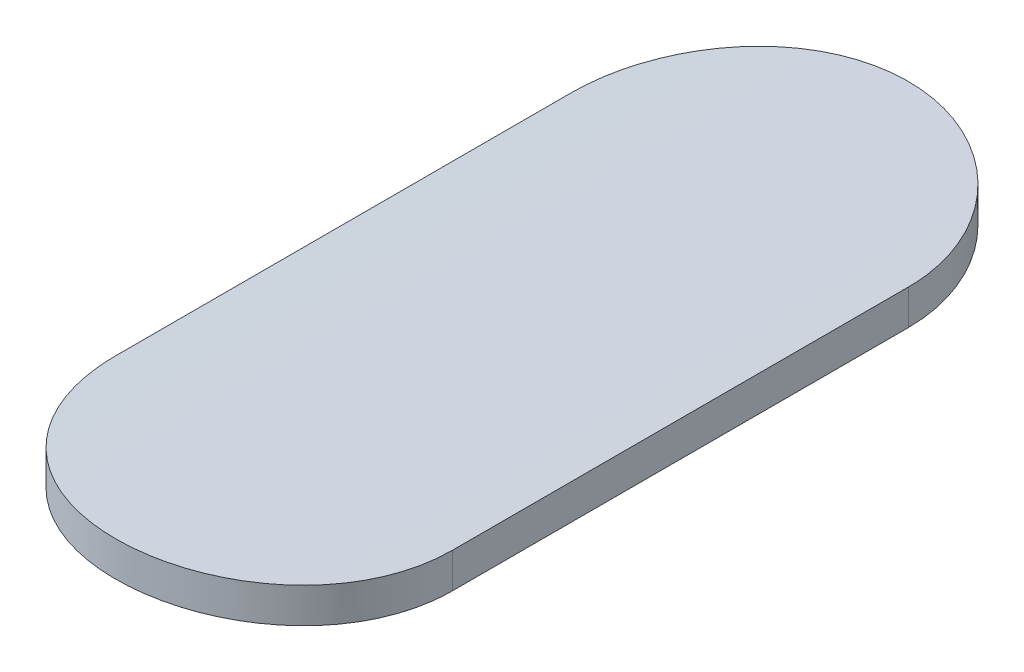
ISO-10303-21;
HEADER;
FILE_DESCRIPTION(('STEP AP214'),'2;1');
FILE_NAME('part.step','',(''),(''),'','','');
FILE_SCHEMA(('AUTOMOTIVE_DESIGN { 1 0 10303 214 1 1 1 1 }'));
ENDSEC;
DATA;
#1=APPLICATION_CONTEXT('core data for automotive mechanical design processes');
#2=APPLICATION_PROTOCOL_DEFINITION('international standard','automotive_design',2000,#1);
#3=PRODUCT_CONTEXT('',#1,'mechanical');
#4=PRODUCT('Part','Part','',(#3));
#5=PRODUCT_RELATED_PRODUCT_CATEGORY('part','',(#4));
#6=PRODUCT_DEFINITION_FORMATION('','',#4);
#7=PRODUCT_DEFINITION_CONTEXT('part definition',#1,'design');
#8=PRODUCT_DEFINITION('design','',#6,#7);
#9=PRODUCT_DEFINITION_SHAPE('','',#8);
#10=(LENGTH_UNIT() NAMED_UNIT(*) SI_UNIT(.MILLI.,.METRE.));
#11=(NAMED_UNIT(*) PLANE_ANGLE_UNIT() SI_UNIT($,.RADIAN.));
#12=(NAMED_UNIT(*) SI_UNIT($,.STERADIAN.) SOLID_ANGLE_UNIT());
#13=UNCERTAINTY_MEASURE_WITH_UNIT(LENGTH_MEASURE(1.E-05),#10,'distance_accuracy_value','');
#14=(GEOMETRIC_REPRESENTATION_CONTEXT(3) GLOBAL_UNCERTAINTY_ASSIGNED_CONTEXT((#13)) GLOBAL_UNIT_ASSIGNED_CONTEXT((#10,
#11,#12)) REPRESENTATION_CONTEXT('',''));
#15=CARTESIAN_POINT('',(0.,0.,0.));
#16=DIRECTION('',(0.,0.,1.));
#17=DIRECTION('',(1.,0.,0.));
#18=AXIS2_PLACEMENT_3D('',#15,#16,#17);
#19=CARTESIAN_POINT('',(-205.237767720161,-97.4477839792411,1.93657000024666));
#20=DIRECTION('',(0.,0.,1.));
#21=DIRECTION('',(1.,0.,0.));
#22=AXIS2_PLACEMENT_3D('',#19,#20,#21);
#23=CYLINDRICAL_SURFACE('',#22,5.00000000000003);
#24=DIRECTION('',(0.,0.,1.));
#25=VECTOR('',#24,1.);
#26=CARTESIAN_POINT('',(-205.816025312001,-92.4813347287725,-1.67728344457962));
#27=LINE('',#26,#25);
#28=CARTESIAN_POINT('',(-205.816025312001,-92.4813347287725,-3.24229252294941));
#29=VERTEX_POINT('',#28);
#30=CARTESIAN_POINT('',(-205.816025312001,-92.4813347287725,-1.67728344457962));
#31=VERTEX_POINT('',#30);
#32=EDGE_CURVE('E72',#29,#31,#27,.T.);
#33=ORIENTED_EDGE('',*,*,#32,.T.);
#34=CARTESIAN_POINT('',(-204.659510128705,-92.4813347287279,-1.67728344457962));
#35=CARTESIAN_POINT('',(-204.65948198318,-92.4813470453749,-1.64486736138541));
#36=CARTESIAN_POINT('',(-204.66223416535,-92.4810176971892,-1.61246199314016));
#37=CARTESIAN_POINT('',(-204.673088717127,-92.4797671597198,-1.54860370701117));
#38=CARTESIAN_POINT('',(-204.681185705116,-92.4788465657793,-1.51714986433024));
#39=CARTESIAN_POINT('',(-204.702524070631,-92.4765042566045,-1.45604569864238));
#40=CARTESIAN_POINT('',(-204.715767326654,-92.4750823584012,-1.42639603877621));
#41=CARTESIAN_POINT('',(-204.747006549714,-92.4719020810574,-1.36974325151918));
#42=CARTESIAN_POINT('',(-204.765001863621,-92.4701437481661,-1.34273976113282));
#43=CARTESIAN_POINT('',(-204.805325364428,-92.4664785790867,-1.29201779207968));
#44=CARTESIAN_POINT('',(-204.827671036202,-92.4645711628689,-1.26831325482103));
#45=CARTESIAN_POINT('',(-204.876032349208,-92.4608275253215,-1.22497397730184));
#46=CARTESIAN_POINT('',(-204.902049364491,-92.4589913309773,-1.20534076761728));
#47=CARTESIAN_POINT('',(-204.957107529511,-92.4555908299197,-1.17065324748611));
#48=CARTESIAN_POINT('',(-204.986158174165,-92.4540274204009,-1.15561392907275));
#49=CARTESIAN_POINT('',(-205.046371666948,-92.4513580548523,-1.13064897149647));
#50=CARTESIAN_POINT('',(-205.077531998354,-92.4502515645608,-1.1207173566954));
#51=CARTESIAN_POINT('',(-205.13034615267,-92.4488934431359,-1.10868003114148));
#52=CARTESIAN_POINT('',(-205.151664012772,-92.4484793797971,-1.10506483473562));
#53=CARTESIAN_POINT('',(-205.194574057236,-92.4479245041211,-1.10023726373118));
#54=CARTESIAN_POINT('',(-205.216166245618,-92.4477836957932,-1.09902492438865));
#55=CARTESIAN_POINT('',(-205.270132833281,-92.4477844039261,-1.09902724415098));
#56=CARTESIAN_POINT('',(-205.302518792684,-92.448101558574,-1.10175224055717));
#57=CARTESIAN_POINT('',(-205.36639046982,-92.449336246177,-1.11258048945381));
#58=CARTESIAN_POINT('',(-205.397875198235,-92.4502544143552,-1.12068943247348));
#59=CARTESIAN_POINT('',(-205.459010687186,-92.4525875978119,-1.14204449856262));
#60=CARTESIAN_POINT('',(-205.488662624789,-92.4540022902267,-1.15528728394617));
#61=CARTESIAN_POINT('',(-205.545317635545,-92.4571708752444,-1.18652753654784));
#62=CARTESIAN_POINT('',(-205.572321144898,-92.4589247118479,-1.20452421898134));
#63=CARTESIAN_POINT('',(-205.623045523049,-92.4625847434808,-1.24485186607937));
#64=CARTESIAN_POINT('',(-205.646752120136,-92.4644915478026,-1.26720072713352));
#65=CARTESIAN_POINT('',(-205.690087991771,-92.4682377457699,-1.31556202071156));
#66=CARTESIAN_POINT('',(-205.709716908808,-92.4700771334931,-1.34157477413163));
#67=CARTESIAN_POINT('',(-205.744395340358,-92.4734866329095,-1.39661981559405));
#68=CARTESIAN_POINT('',(-205.759430426865,-92.4750558895899,-1.42566124048829));
#69=CARTESIAN_POINT('',(-205.784398136002,-92.4777383200303,-1.48587384864348));
#70=CARTESIAN_POINT('',(-205.794333600315,-92.4788517477236,-1.51704383480183));
#71=CARTESIAN_POINT('',(-205.806375173798,-92.4802182866102,-1.56988157809094));
#72=CARTESIAN_POINT('',(-205.809991257807,-92.4806348583557,-1.59121323535456));
#73=CARTESIAN_POINT('',(-205.81481628588,-92.4811939415349,-1.63412129934428));
#74=CARTESIAN_POINT('',(-205.816028473882,-92.4813368222921,-1.65569733666952));
#75=CARTESIAN_POINT('',(-205.816025312001,-92.4813347287726,-1.67728344457962));
#76=B_SPLINE_CURVE_WITH_KNOTS('',3,(#34,#35,#36,#37,#38,#39,#40,#41,#42,#43,#44,#45,#46,#47,#48,
#49,#50,#51,#52,#53,#54,#55,#56,#57,#58,#59,#60,#61,#62,#63,#64,#65,#66,#67,#68,#69,#70,#71,#72,
#73,#74,#75),.UNSPECIFIED.,.F.,.F.,(4,2,2,2,2,2,2,2,2,2,2,2,2,2,2,2,2,2,2,2,4),(0.,
0.0971141698560029,0.194130705514868,0.291182687565274,0.388221337553571,0.485658369900075,
0.583131966607678,0.680920348294421,0.778594063001623,0.843344867671608,0.908096622394176,
1.0051130474093,1.10223217692016,1.19928827157682,1.29632835398478,1.39377623360661,
1.49123265335908,1.58899208404563,1.68669698057033,1.75148885975865,1.81619324588167),.UNSPECIFIED.);
#77=CARTESIAN_POINT('',(-204.659510128705,-92.4813347287279,-1.67728344457962));
#78=VERTEX_POINT('',#77);
#79=EDGE_CURVE('E21',#78,#31,#76,.T.);
#80=ORIENTED_EDGE('',*,*,#79,.F.);
#81=DIRECTION('',(0.,0.,1.));
#82=VECTOR('',#81,1.);
#83=CARTESIAN_POINT('',(-204.659510128705,-92.4813347287279,-3.24229252294941));
#84=LINE('',#83,#82);
#85=CARTESIAN_POINT('',(-204.659510128705,-92.4813347287279,-3.24229252294941));
#86=VERTEX_POINT('',#85);
#87=EDGE_CURVE('E59',#78,#86,#84,.F.);
#88=ORIENTED_EDGE('',*,*,#87,.T.);
#89=CARTESIAN_POINT('',(-205.816025312001,-92.4813347287726,-3.24229252294941));
#90=CARTESIAN_POINT('',(-205.81605345322,-92.4813470455981,-3.27470870328742));
#91=CARTESIAN_POINT('',(-205.813301256707,-92.4810176953498,-3.30711416843688));
#92=CARTESIAN_POINT('',(-205.802446677341,-92.4797671542148,-3.37097244911427));
#93=CARTESIAN_POINT('',(-205.794349708049,-92.4788465622047,-3.40242619493162));
#94=CARTESIAN_POINT('',(-205.773011592033,-92.4765042816047,-3.46352962042137));
#95=CARTESIAN_POINT('',(-205.759768660538,-92.4750824191753,-3.49317867004022));
#96=CARTESIAN_POINT('',(-205.728529674045,-92.4719021558279,-3.54983156341704));
#97=CARTESIAN_POINT('',(-205.710534070537,-92.4701437868815,-3.57683565810421));
#98=CARTESIAN_POINT('',(-205.670207756246,-92.4664783744416,-3.62756102105006));
#99=CARTESIAN_POINT('',(-205.647859171863,-92.4645707380577,-3.65126803884865));
#100=CARTESIAN_POINT('',(-205.599497501548,-92.460827112354,-3.69460636258599));
#101=CARTESIAN_POINT('',(-205.573483858366,-92.4589911339836,-3.71423704761921));
#102=CARTESIAN_POINT('',(-205.518441967116,-92.4555917582716,-3.7489134129016));
#103=CARTESIAN_POINT('',(-205.489405485113,-92.4540291382538,-3.76394610616435));
#104=CARTESIAN_POINT('',(-205.429200909222,-92.4513592357457,-3.78891582297535));
#105=CARTESIAN_POINT('',(-205.398033010825,-92.4502519115612,-3.79885331314227));
#106=CARTESIAN_POINT('',(-205.334596648131,-92.4486214638352,-3.81330876046691));
#107=CARTESIAN_POINT('',(-205.302333729771,-92.4480957495245,-3.81785075846227));
#108=CARTESIAN_POINT('',(-205.237498790808,-92.4476789168199,-3.82146077224401));
#109=CARTESIAN_POINT('',(-205.204926773204,-92.4477877922755,-3.82052884108343));
#110=CARTESIAN_POINT('',(-205.140563410856,-92.4486257894006,-3.81323661881066));
#111=CARTESIAN_POINT('',(-205.108769075323,-92.4493519393145,-3.80690233585537));
#112=CARTESIAN_POINT('',(-205.046697948224,-92.4513395212461,-3.78902585126197));
#113=CARTESIAN_POINT('',(-205.016421173954,-92.4526009593627,-3.77748359028473));
#114=CARTESIAN_POINT('',(-204.958162773233,-92.4555225006161,-3.74949052704906));
#115=CARTESIAN_POINT('',(-204.930186698027,-92.4571835321094,-3.7330282724948));
#116=CARTESIAN_POINT('',(-204.87738579882,-92.4607180906581,-3.69567163655664));
#117=CARTESIAN_POINT('',(-204.852560962508,-92.4625916168832,-3.67477727248999));
#118=CARTESIAN_POINT('',(-204.806616299284,-92.4663540775476,-3.62900660598584));
#119=CARTESIAN_POINT('',(-204.785518493568,-92.4682430387985,-3.60410819518478));
#120=CARTESIAN_POINT('',(-204.747792196947,-92.4718132541877,-3.55110334086045));
#121=CARTESIAN_POINT('',(-204.731165046413,-92.473494445952,-3.52299593882258));
#122=CARTESIAN_POINT('',(-204.702849827051,-92.4764596597479,-3.46434379804802));
#123=CARTESIAN_POINT('',(-204.691166312109,-92.4777433152941,-3.43379684274047));
#124=CARTESIAN_POINT('',(-204.67312304922,-92.479759834021,-3.37119346196273));
#125=CARTESIAN_POINT('',(-204.666755270332,-92.4804935279044,-3.3391393911043));
#126=CARTESIAN_POINT('',(-204.660710580302,-92.4811955947182,-3.28537380442094));
#127=CARTESIAN_POINT('',(-204.659499727931,-92.4813388156744,-3.26382805588258));
#128=CARTESIAN_POINT('',(-204.659510128705,-92.4813347287279,-3.24229252294941));
#129=B_SPLINE_CURVE_WITH_KNOTS('',3,(#89,#90,#91,#92,#93,#94,#95,#96,#97,#98,#99,#100,#101,#102,
#103,#104,#105,#106,#107,#108,#109,#110,#111,#112,#113,#114,#115,#116,#117,#118,#119,#120,#121,
#122,#123,#124,#125,#126,#127,#128),.UNSPECIFIED.,.F.,.F.,(4,2,2,2,2,2,2,2,2,2,2,2,2,2,2,2,2,2,
2,4),(0.,0.0971144596016323,0.194130705508774,0.291180629617421,0.388221337577801,
0.485669235955009,0.583131966690333,0.680867490696617,0.778594062484607,0.875883538275932,
0.973172071143984,1.06999486157763,1.16681875522746,1.2638698053772,1.36092047633352,
1.4585266740161,1.55616210298787,1.65388727516013,1.75146453691094,1.81606442695371),.UNSPECIFIED.);
#130=EDGE_CURVE('E73',#29,#86,#129,.T.);
#131=ORIENTED_EDGE('',*,*,#130,.F.);
#132=EDGE_LOOP('',(#33,#80,#88,#131));
#133=FACE_BOUND('',#132,.T.);
#134=ADVANCED_FACE('F17',(#133),#23,.T.);
#135=CARTESIAN_POINT('',(-205.816025312001,-90.5682667595488,-1.67728344457962));
#136=DIRECTION('',(1.,0.,0.));
#137=DIRECTION('',(0.,1.,0.));
#138=AXIS2_PLACEMENT_3D('',#135,#136,#137);
#139=PLANE('',#138);
#140=DIRECTION('',(0.,0.,1.));
#141=VECTOR('',#140,1.);
#142=CARTESIAN_POINT('',(-205.816025312001,-92.6021655298087,1.93657000024666));
#143=LINE('',#142,#141);
#144=CARTESIAN_POINT('',(-205.816025312001,-92.6021655298087,-3.24229252294941));
#145=VERTEX_POINT('',#144);
#146=CARTESIAN_POINT('',(-205.816025312001,-92.6021655298087,-1.67728344457962));
#147=VERTEX_POINT('',#146);
#148=EDGE_CURVE('E80',#145,#147,#143,.T.);
#149=ORIENTED_EDGE('',*,*,#148,.T.);
#150=DIRECTION('',(0.,1.,0.));
#151=VECTOR('',#150,1.);
#152=CARTESIAN_POINT('',(-205.816025312001,-90.5682667595488,-1.67728344457962));
#153=LINE('',#152,#151);
#154=EDGE_CURVE('E67',#31,#147,#153,.F.);
#155=ORIENTED_EDGE('',*,*,#154,.F.);
#156=ORIENTED_EDGE('',*,*,#32,.F.);
#157=DIRECTION('',(0.,1.,0.));
#158=VECTOR('',#157,1.);
#159=CARTESIAN_POINT('',(-205.816025312001,-90.5682667595488,-3.24229252294941));
#160=LINE('',#159,#158);
#161=EDGE_CURVE('E106',#145,#29,#160,.T.);
#162=ORIENTED_EDGE('',*,*,#161,.F.);
#163=EDGE_LOOP('',(#149,#155,#156,#162));
#164=FACE_BOUND('',#163,.T.);
#165=ADVANCED_FACE('F79',(#164),#139,.F.);
#166=CARTESIAN_POINT('',(-205.237767720353,-90.5682667595488,-1.67728344457962));
#167=DIRECTION('',(0.,1.,0.));
#168=DIRECTION('',(0.,0.,1.));
#169=AXIS2_PLACEMENT_3D('',#166,#167,#168);
#170=CYLINDRICAL_SURFACE('',#169,0.578257591648153);
#171=DIRECTION('',(0.,1.,0.));
#172=VECTOR('',#171,1.);
#173=CARTESIAN_POINT('',(-204.659510128705,-90.5682667595488,-1.67728344457962));
#174=LINE('',#173,#172);
#175=CARTESIAN_POINT('',(-204.659510128705,-92.6021655297629,-1.67728344457962));
#176=VERTEX_POINT('',#175);
#177=EDGE_CURVE('E69',#176,#78,#174,.T.);
#178=ORIENTED_EDGE('',*,*,#177,.T.);
#179=ORIENTED_EDGE('',*,*,#79,.T.);
#180=ORIENTED_EDGE('',*,*,#154,.T.);
#181=CARTESIAN_POINT('',(-205.816025312001,-92.6021655298087,-1.67728344457962));
#182=CARTESIAN_POINT('',(-205.816053483011,-92.6021781533448,-1.6448730846635));
#183=CARTESIAN_POINT('',(-205.813302242279,-92.6018407072796,-1.61247356318601));
#184=CARTESIAN_POINT('',(-205.802451748411,-92.6005594713111,-1.54862744613858));
#185=CARTESIAN_POINT('',(-205.79435794951,-92.5996162998216,-1.517179912889));
#186=CARTESIAN_POINT('',(-205.773028532762,-92.5972166227453,-1.45608830842007));
#187=CARTESIAN_POINT('',(-205.759791067541,-92.5957599327431,-1.42644488958729));
#188=CARTESIAN_POINT('',(-205.72856598305,-92.592501890348,-1.36980331287443));
#189=CARTESIAN_POINT('',(-205.710578992223,-92.5907005835624,-1.34280480567491));
#190=CARTESIAN_POINT('',(-205.670270074694,-92.5869454143927,-1.29208533071531));
#191=CARTESIAN_POINT('',(-205.647929782689,-92.5849909274355,-1.26837900399511));
#192=CARTESIAN_POINT('',(-205.599578955999,-92.5811547858218,-1.22503482303745));
#193=CARTESIAN_POINT('',(-205.573567048307,-92.5792731587483,-1.20539849759556));
#194=CARTESIAN_POINT('',(-205.518514038446,-92.5757880639238,-1.17070078857362));
#195=CARTESIAN_POINT('',(-205.489463015216,-92.5741855557636,-1.15565505890041));
#196=CARTESIAN_POINT('',(-205.429246573441,-92.5714492396962,-1.13067775108621));
#197=CARTESIAN_POINT('',(-205.398083675089,-92.5703148842015,-1.1207401946693));
#198=CARTESIAN_POINT('',(-205.345254120649,-92.568922106144,-1.10869179239081));
#199=CARTESIAN_POINT('',(-205.323923699689,-92.5684973477259,-1.10507220606532));
#200=CARTESIAN_POINT('',(-205.280987857234,-92.5679281371332,-1.10023875435242));
#201=CARTESIAN_POINT('',(-205.259382431801,-92.5677836889786,-1.09902492346591));
#202=CARTESIAN_POINT('',(-205.205408498434,-92.5677844137908,-1.09902724442736));
#203=CARTESIAN_POINT('',(-205.173028463901,-92.5681092485121,-1.1017512611566));
#204=CARTESIAN_POINT('',(-205.109168744159,-92.5693738397721,-1.11257543381646));
#205=CARTESIAN_POINT('',(-205.077690046997,-92.5703142460471,-1.1206812703921));
#206=CARTESIAN_POINT('',(-205.016566704827,-92.572703965736,-1.14202760073034));
#207=CARTESIAN_POINT('',(-204.986920864252,-92.5741529432019,-1.155264705521));
#208=CARTESIAN_POINT('',(-204.930276903842,-92.5773984387611,-1.18649104008967));
#209=CARTESIAN_POINT('',(-204.903278353576,-92.5791949002142,-1.20447949556857));
#210=CARTESIAN_POINT('',(-204.852556592957,-92.5829445142571,-1.24479264157334));
#211=CARTESIAN_POINT('',(-204.828848336295,-92.5848983222903,-1.26713608647045));
#212=CARTESIAN_POINT('',(-204.785507790757,-92.5887372053062,-1.31548678987649));
#213=CARTESIAN_POINT('',(-204.765875861897,-92.5906222742059,-1.34149437165702));
#214=CARTESIAN_POINT('',(-204.731187341408,-92.5941170846154,-1.39653422730785));
#215=CARTESIAN_POINT('',(-204.716145861998,-92.5957259092593,-1.42557607797911));
#216=CARTESIAN_POINT('',(-204.691165865014,-92.5984762631509,-1.48579168189021));
#217=CARTESIAN_POINT('',(-204.681224494261,-92.5996180536012,-1.51696423205588));
#218=CARTESIAN_POINT('',(-204.669171948261,-92.6010198762337,-1.56981720380373));
#219=CARTESIAN_POINT('',(-204.665551522192,-92.601447339911,-1.59116124412297));
#220=CARTESIAN_POINT('',(-204.660720634795,-92.6020210553048,-1.63409488443761));
#221=CARTESIAN_POINT('',(-204.659506943357,-92.6021676839245,-1.65568411614209));
#222=CARTESIAN_POINT('',(-204.659510128705,-92.6021655297629,-1.67728344457961));
#223=B_SPLINE_CURVE_WITH_KNOTS('',3,(#181,#182,#183,#184,#185,#186,#187,#188,#189,#190,#191,
#192,#193,#194,#195,#196,#197,#198,#199,#200,#201,#202,#203,#204,#205,#206,#207,#208,#209,#210,
#211,#212,#213,#214,#215,#216,#217,#218,#219,#220,#221,#222),.UNSPECIFIED.,.F.,.F.,(4,2,2,2,2,2,
2,2,2,2,2,2,2,2,2,2,2,2,2,2,4),(0.,0.0970967769414802,0.19409458046097,0.291127253506242,
0.388147093901721,0.485585457891435,0.583060356133906,0.680864021117861,0.77855296090041,
0.843343411859866,0.908134791971192,1.00513347976351,1.10223471520449,1.19927192861068,
1.29629333819037,1.39374218059266,1.49119962589251,1.58897453338934,1.68669468236564,
1.75152566852516,1.81626958514255),.UNSPECIFIED.);
#224=EDGE_CURVE('E91',#147,#176,#223,.T.);
#225=ORIENTED_EDGE('',*,*,#224,.T.);
#226=EDGE_LOOP('',(#178,#179,#180,#225));
#227=FACE_BOUND('',#226,.T.);
#228=ADVANCED_FACE('F65',(#227),#170,.T.);
#229=CARTESIAN_POINT('',(-204.659510128705,-90.5682667595488,-3.24229252294941));
#230=DIRECTION('',(-1.,0.,0.));
#231=DIRECTION('',(0.,0.,1.));
#232=AXIS2_PLACEMENT_3D('',#229,#230,#231);
#233=PLANE('',#232);
#234=DIRECTION('',(0.,0.,1.));
#235=VECTOR('',#234,1.);
#236=CARTESIAN_POINT('',(-204.659510128705,-92.6021655297629,1.93657000024666));
#237=LINE('',#236,#235);
#238=CARTESIAN_POINT('',(-204.659510128705,-92.6021655297629,-3.24229252294941));
#239=VERTEX_POINT('',#238);
#240=EDGE_CURVE('E31',#176,#239,#237,.F.);
#241=ORIENTED_EDGE('',*,*,#240,.T.);
#242=DIRECTION('',(0.,1.,0.));
#243=VECTOR('',#242,1.);
#244=CARTESIAN_POINT('',(-204.659510128705,-90.5682667595488,-3.24229252294941));
#245=LINE('',#244,#243);
#246=EDGE_CURVE('E39',#86,#239,#245,.F.);
#247=ORIENTED_EDGE('',*,*,#246,.F.);
#248=ORIENTED_EDGE('',*,*,#87,.F.);
#249=ORIENTED_EDGE('',*,*,#177,.F.);
#250=EDGE_LOOP('',(#241,#247,#248,#249));
#251=FACE_BOUND('',#250,.T.);
#252=ADVANCED_FACE('F101',(#251),#233,.F.);
#253=CARTESIAN_POINT('',(-205.237767720353,-90.5682667595488,-3.24229252294941));
#254=DIRECTION('',(0.,1.,0.));
#255=DIRECTION('',(0.,0.,1.));
#256=AXIS2_PLACEMENT_3D('',#253,#254,#255);
#257=CYLINDRICAL_SURFACE('',#256,0.57825759164816);
#258=ORIENTED_EDGE('',*,*,#246,.T.);
#259=CARTESIAN_POINT('',(-204.659510128705,-92.6021655297629,-3.24229252294941));
#260=CARTESIAN_POINT('',(-204.659481961999,-92.6021781534809,-3.27470297895291));
#261=CARTESIAN_POINT('',(-204.662233216893,-92.6018407053248,-3.30710259628175));
#262=CARTESIAN_POINT('',(-204.673083737999,-92.6005594656419,-3.37094870793766));
#263=CARTESIAN_POINT('',(-204.681177518388,-92.5996162961099,-3.40239614537805));
#264=CARTESIAN_POINT('',(-204.702506686611,-92.5972166482127,-3.46348701230909));
#265=CARTESIAN_POINT('',(-204.715743828236,-92.5957599947747,-3.49312982246287));
#266=CARTESIAN_POINT('',(-204.746968676782,-92.5925019666882,-3.54977150499114));
#267=CARTESIAN_POINT('',(-204.764955956315,-92.5907006230568,-3.57677061492968));
#268=CARTESIAN_POINT('',(-204.805267682024,-92.5869452049457,-3.62749347830619));
#269=CARTESIAN_POINT('',(-204.827610881779,-92.5849904927257,-3.65120228210514));
#270=CARTESIAN_POINT('',(-204.875962064954,-92.5811543632185,-3.69454551096305));
#271=CARTESIAN_POINT('',(-204.901970605743,-92.5792729571343,-3.71417931523553));
#272=CARTESIAN_POINT('',(-204.957007359644,-92.5757890145145,-3.74886587681112));
#273=CARTESIAN_POINT('',(-204.986044233256,-92.5741873148731,-3.76390498389108));
#274=CARTESIAN_POINT('',(-205.046251761114,-92.5714504492918,-3.78888704683265));
#275=CARTESIAN_POINT('',(-205.077422216702,-92.5703152399854,-3.79883047642559));
#276=CARTESIAN_POINT('',(-205.140858450405,-92.5686436759724,-3.81329497855131));
#277=CARTESIAN_POINT('',(-205.173118400204,-92.5681045352239,-3.81784128482099));
#278=CARTESIAN_POINT('',(-205.237948363892,-92.5676763461855,-3.82146067830574));
#279=CARTESIAN_POINT('',(-205.270518374271,-92.5677872905474,-3.82053382738679));
#280=CARTESIAN_POINT('',(-205.334870590047,-92.5686445338117,-3.81325331452293));
#281=CARTESIAN_POINT('',(-205.366655931583,-92.5693876374871,-3.80692694373421));
#282=CARTESIAN_POINT('',(-205.428710384106,-92.571422086611,-3.78906962837978));
#283=CARTESIAN_POINT('',(-205.458979476824,-92.5727134386636,-3.77753862111902));
#284=CARTESIAN_POINT('',(-205.517227863834,-92.5757048001304,-3.74956981745013));
#285=CARTESIAN_POINT('',(-205.545201352274,-92.5774058053395,-3.73312004046389));
#286=CARTESIAN_POINT('',(-205.597999733442,-92.5810258910445,-3.6957901378272));
#287=CARTESIAN_POINT('',(-205.622824631438,-92.5829449711756,-3.67491001958794));
#288=CARTESIAN_POINT('',(-205.668779656381,-92.5868000571643,-3.62916208775789));
#289=CARTESIAN_POINT('',(-205.689886659469,-92.5887360953951,-3.60427104209134));
#290=CARTESIAN_POINT('',(-205.727632669796,-92.5923958859476,-3.55127877400842));
#291=CARTESIAN_POINT('',(-205.74427034065,-92.5941195746911,-3.52317659499592));
#292=CARTESIAN_POINT('',(-205.772607859074,-92.5971604007767,-3.46453132814129));
#293=CARTESIAN_POINT('',(-205.784303026303,-92.5984771524508,-3.43398595910039));
#294=CARTESIAN_POINT('',(-205.802369312691,-92.6005463291697,-3.37138277105374));
#295=CARTESIAN_POINT('',(-205.808748459045,-92.6012996048868,-3.33932730990848));
#296=CARTESIAN_POINT('',(-205.814817911293,-92.6020220986538,-3.28549818222512));
#297=CARTESIAN_POINT('',(-205.816035806626,-92.6021697551819,-3.26389026313558));
#298=CARTESIAN_POINT('',(-205.816025312001,-92.6021655298087,-3.24229252294941));
#299=B_SPLINE_CURVE_WITH_KNOTS('',3,(#259,#260,#261,#262,#263,#264,#265,#266,#267,#268,#269,
#270,#271,#272,#273,#274,#275,#276,#277,#278,#279,#280,#281,#282,#283,#284,#285,#286,#287,#288,
#289,#290,#291,#292,#293,#294,#295,#296,#297,#298),.UNSPECIFIED.,.F.,.F.,(4,2,2,2,2,2,2,2,2,2,2,
2,2,2,2,2,2,2,2,4),(0.,0.0970970635383439,0.194094580457033,0.291125200809994,0.388147093931789,
0.485596307798213,0.583060356224489,0.680811202926225,0.778552960347214,0.875835912772297,
0.973117765558745,1.06991081233851,1.1667050251181,1.26373694568975,1.36076870394509,
1.45838414810372,1.55602874807589,1.65376560730432,1.75135461501377,1.81614074530075),.UNSPECIFIED.);
#300=EDGE_CURVE('E11',#239,#145,#299,.T.);
#301=ORIENTED_EDGE('',*,*,#300,.T.);
#302=ORIENTED_EDGE('',*,*,#161,.T.);
#303=ORIENTED_EDGE('',*,*,#130,.T.);
#304=EDGE_LOOP('',(#258,#301,#302,#303));
#305=FACE_BOUND('',#304,.T.);
#306=ADVANCED_FACE('F97',(#305),#257,.T.);
#307=CARTESIAN_POINT('',(-205.237767720161,-97.4477839792411,1.93657000024666));
#308=DIRECTION('',(0.,0.,1.));
#309=DIRECTION('',(1.,0.,0.));
#310=AXIS2_PLACEMENT_3D('',#307,#308,#309);
#311=CYLINDRICAL_SURFACE('',#310,4.88000000000002);
#312=ORIENTED_EDGE('',*,*,#240,.F.);
#313=ORIENTED_EDGE('',*,*,#224,.F.);
#314=ORIENTED_EDGE('',*,*,#148,.F.);
#315=ORIENTED_EDGE('',*,*,#300,.F.);
#316=EDGE_LOOP('',(#312,#313,#314,#315));
#317=FACE_BOUND('',#316,.T.);
#318=ADVANCED_FACE('F95',(#317),#311,.F.);
#319=CLOSED_SHELL('',(#134,#165,#228,#252,#306,#318));
#320=MANIFOLD_SOLID_BREP('B1',#319);
#321=ADVANCED_BREP_SHAPE_REPRESENTATION('',(#18,#320),#14);
#322=SHAPE_DEFINITION_REPRESENTATION(#9,#321);
ENDSEC;
END-ISO-10303-21;
